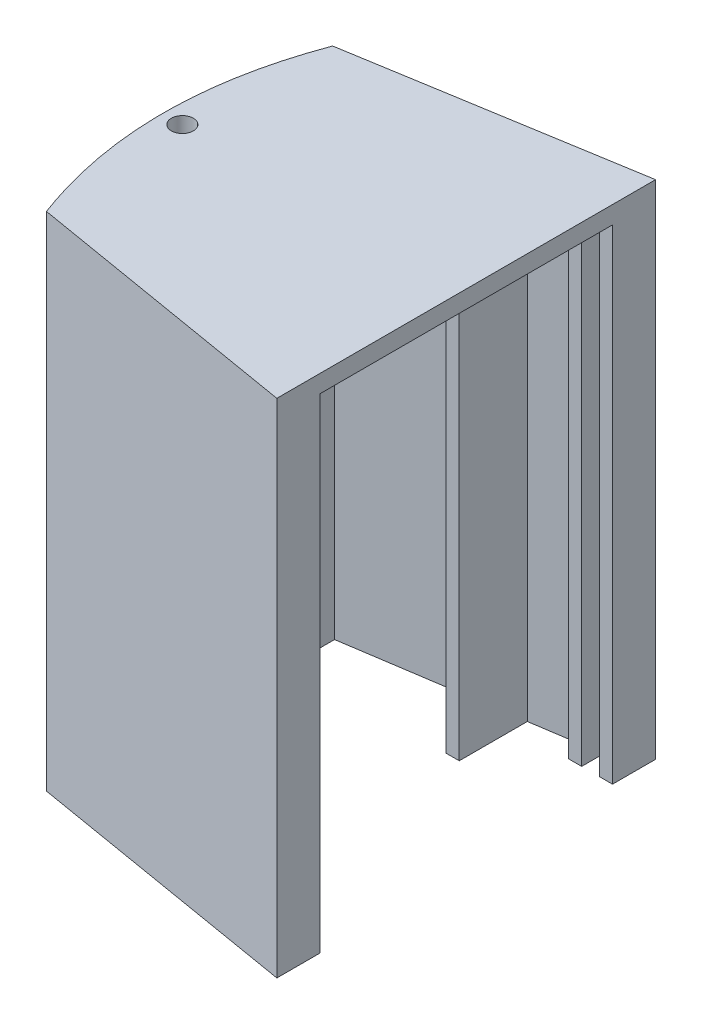
ISO-10303-21;
HEADER;
FILE_DESCRIPTION(('STEP AP214'),'2;1');
FILE_NAME('part.step','',(''),(''),'','','');
FILE_SCHEMA(('AUTOMOTIVE_DESIGN { 1 0 10303 214 1 1 1 1 }'));
ENDSEC;
DATA;
#1=APPLICATION_CONTEXT('core data for automotive mechanical design processes');
#2=APPLICATION_PROTOCOL_DEFINITION('international standard','automotive_design',2000,#1);
#3=PRODUCT_CONTEXT('',#1,'mechanical');
#4=PRODUCT('Part','Part','',(#3));
#5=PRODUCT_RELATED_PRODUCT_CATEGORY('part','',(#4));
#6=PRODUCT_DEFINITION_FORMATION('','',#4);
#7=PRODUCT_DEFINITION_CONTEXT('part definition',#1,'design');
#8=PRODUCT_DEFINITION('design','',#6,#7);
#9=PRODUCT_DEFINITION_SHAPE('','',#8);
#10=(LENGTH_UNIT() NAMED_UNIT(*) SI_UNIT(.MILLI.,.METRE.));
#11=(NAMED_UNIT(*) PLANE_ANGLE_UNIT() SI_UNIT($,.RADIAN.));
#12=(NAMED_UNIT(*) SI_UNIT($,.STERADIAN.) SOLID_ANGLE_UNIT());
#13=UNCERTAINTY_MEASURE_WITH_UNIT(LENGTH_MEASURE(1.E-05),#10,'distance_accuracy_value','');
#14=(GEOMETRIC_REPRESENTATION_CONTEXT(3) GLOBAL_UNCERTAINTY_ASSIGNED_CONTEXT((#13)) GLOBAL_UNIT_ASSIGNED_CONTEXT((#10,
#11,#12)) REPRESENTATION_CONTEXT('',''));
#15=CARTESIAN_POINT('',(0.,0.,0.));
#16=DIRECTION('',(0.,0.,1.));
#17=DIRECTION('',(1.,0.,0.));
#18=AXIS2_PLACEMENT_3D('',#15,#16,#17);
#19=CARTESIAN_POINT('',(27.2040718904746,110.,-33.1151884914395));
#20=DIRECTION('',(0.,0.,-1.));
#21=DIRECTION('',(-1.,0.,0.));
#22=AXIS2_PLACEMENT_3D('',#19,#20,#21);
#23=PLANE('',#22);
#24=DIRECTION('',(1.,0.,0.));
#25=VECTOR('',#24,1.);
#26=CARTESIAN_POINT('',(27.2040718904746,0.,-33.1151884914395));
#27=LINE('',#26,#25);
#28=CARTESIAN_POINT('',(24.2040718904746,0.,-33.1151884914395));
#29=VERTEX_POINT('',#28);
#30=CARTESIAN_POINT('',(27.2040718904746,0.,-33.1151884914395));
#31=VERTEX_POINT('',#30);
#32=EDGE_CURVE('E255',#29,#31,#27,.T.);
#33=ORIENTED_EDGE('',*,*,#32,.T.);
#34=DIRECTION('',(0.,-1.,0.));
#35=VECTOR('',#34,1.);
#36=CARTESIAN_POINT('',(27.2040718904746,110.,-33.1151884914395));
#37=LINE('',#36,#35);
#38=CARTESIAN_POINT('',(27.2040718904746,110.,-33.1151884914395));
#39=VERTEX_POINT('',#38);
#40=EDGE_CURVE('E11',#39,#31,#37,.T.);
#41=ORIENTED_EDGE('',*,*,#40,.F.);
#42=DIRECTION('',(1.,0.,0.));
#43=VECTOR('',#42,1.);
#44=CARTESIAN_POINT('',(27.2040718904746,110.,-33.1151884914395));
#45=LINE('',#44,#43);
#46=CARTESIAN_POINT('',(24.2040718904746,110.,-33.1151884914395));
#47=VERTEX_POINT('',#46);
#48=EDGE_CURVE('E315',#47,#39,#45,.T.);
#49=ORIENTED_EDGE('',*,*,#48,.F.);
#50=DIRECTION('',(0.,-1.,0.));
#51=VECTOR('',#50,1.);
#52=CARTESIAN_POINT('',(24.2040718904746,110.,-33.1151884914395));
#53=LINE('',#52,#51);
#54=EDGE_CURVE('E254',#47,#29,#53,.T.);
#55=ORIENTED_EDGE('',*,*,#54,.T.);
#56=EDGE_LOOP('',(#33,#41,#49,#55));
#57=FACE_BOUND('',#56,.T.);
#58=ADVANCED_FACE('F33',(#57),#23,.F.);
#59=CARTESIAN_POINT('',(-35.7453822194024,110.,-32.5135125971341));
#60=DIRECTION('',(0.162742598197496,0.,0.986668559715941));
#61=DIRECTION('',(0.986668559715941,0.,-0.162742598197496));
#62=AXIS2_PLACEMENT_3D('',#59,#60,#61);
#63=PLANE('',#62);
#64=DIRECTION('',(-0.98666855971594,0.,0.162742598197496));
#65=VECTOR('',#64,1.);
#66=CARTESIAN_POINT('',(-35.7453822194024,0.,-32.5135125971341));
#67=LINE('',#66,#65);
#68=CARTESIAN_POINT('',(27.2040718904746,0.,-42.8964903621343));
#69=VERTEX_POINT('',#68);
#70=CARTESIAN_POINT('',(-35.7453822194024,0.,-32.5135125971341));
#71=VERTEX_POINT('',#70);
#72=EDGE_CURVE('E260',#69,#71,#67,.T.);
#73=ORIENTED_EDGE('',*,*,#72,.T.);
#74=DIRECTION('',(0.,-1.,0.));
#75=VECTOR('',#74,1.);
#76=CARTESIAN_POINT('',(-35.7453822194024,110.,-32.5135125971341));
#77=LINE('',#76,#75);
#78=CARTESIAN_POINT('',(-35.7453822194024,110.,-32.5135125971341));
#79=VERTEX_POINT('',#78);
#80=EDGE_CURVE('E380',#79,#71,#77,.T.);
#81=ORIENTED_EDGE('',*,*,#80,.F.);
#82=DIRECTION('',(0.,-1.,0.));
#83=VECTOR('',#82,1.);
#84=CARTESIAN_POINT('',(-35.7453822194024,114.,-32.5135125971341));
#85=LINE('',#84,#83);
#86=CARTESIAN_POINT('',(-35.7453822194024,114.,-32.5135125971341));
#87=VERTEX_POINT('',#86);
#88=EDGE_CURVE('E416',#87,#79,#85,.T.);
#89=ORIENTED_EDGE('',*,*,#88,.F.);
#90=DIRECTION('',(-0.98666855971594,0.,0.162742598197496));
#91=VECTOR('',#90,1.);
#92=CARTESIAN_POINT('',(-35.7453822194024,114.,-32.5135125971341));
#93=LINE('',#92,#91);
#94=CARTESIAN_POINT('',(27.2040718904746,114.,-42.8964903621343));
#95=VERTEX_POINT('',#94);
#96=EDGE_CURVE('E391',#95,#87,#93,.T.);
#97=ORIENTED_EDGE('',*,*,#96,.F.);
#98=DIRECTION('',(0.,-1.,0.));
#99=VECTOR('',#98,1.);
#100=CARTESIAN_POINT('',(27.2040718904746,110.,-42.8964903621343));
#101=LINE('',#100,#99);
#102=EDGE_CURVE('E41',#95,#69,#101,.T.);
#103=ORIENTED_EDGE('',*,*,#102,.T.);
#104=EDGE_LOOP('',(#73,#81,#89,#97,#103));
#105=FACE_BOUND('',#104,.T.);
#106=ADVANCED_FACE('F387',(#105),#63,.F.);
#107=CARTESIAN_POINT('',(-35.7453822194024,110.,-32.5135125971341));
#108=CARTESIAN_POINT('',(-47.8640782963114,110.,0.00437010478615047));
#109=CARTESIAN_POINT('',(-35.7101712220683,110.,32.509265277089));
#110=B_SPLINE_CURVE_WITH_KNOTS('',2,(#107,#108,#109),.UNSPECIFIED.,.F.,.F.,(3,3),(0.,1.),.UNSPECIFIED.);
#111=DIRECTION('',(0.,-1.,0.));
#112=VECTOR('',#111,1.);
#113=SURFACE_OF_LINEAR_EXTRUSION('',#110,#112);
#114=CARTESIAN_POINT('',(-35.7453822194024,0.,-32.5135125971341));
#115=CARTESIAN_POINT('',(-47.8640782963114,0.,0.00437010478615047));
#116=CARTESIAN_POINT('',(-35.7101712220683,0.,32.509265277089));
#117=B_SPLINE_CURVE_WITH_KNOTS('',2,(#114,#115,#116),.UNSPECIFIED.,.F.,.F.,(3,3),(0.,1.),.UNSPECIFIED.);
#118=CARTESIAN_POINT('',(-35.7101712220683,0.,32.509265277089));
#119=VERTEX_POINT('',#118);
#120=EDGE_CURVE('E262',#71,#119,#117,.T.);
#121=ORIENTED_EDGE('',*,*,#120,.T.);
#122=DIRECTION('',(0.,-1.,0.));
#123=VECTOR('',#122,1.);
#124=CARTESIAN_POINT('',(-35.7101712220683,110.,32.509265277089));
#125=LINE('',#124,#123);
#126=CARTESIAN_POINT('',(-35.7101712220683,110.,32.509265277089));
#127=VERTEX_POINT('',#126);
#128=EDGE_CURVE('E377',#127,#119,#125,.T.);
#129=ORIENTED_EDGE('',*,*,#128,.F.);
#130=EDGE_CURVE('E419',#79,#127,#110,.T.);
#131=ORIENTED_EDGE('',*,*,#130,.F.);
#132=ORIENTED_EDGE('',*,*,#80,.T.);
#133=EDGE_LOOP('',(#121,#129,#131,#132));
#134=FACE_BOUND('',#133,.T.);
#135=ADVANCED_FACE('F401',(#134),#113,.F.);
#136=CARTESIAN_POINT('',(-35.7101712220683,110.,32.509265277089));
#137=DIRECTION('',(0.16605398684603,0.,-0.986116663206002));
#138=DIRECTION('',(-0.986116663206002,0.,-0.16605398684603));
#139=AXIS2_PLACEMENT_3D('',#136,#137,#138);
#140=PLANE('',#139);
#141=DIRECTION('',(0.986116663206001,0.,0.16605398684603));
#142=VECTOR('',#141,1.);
#143=CARTESIAN_POINT('',(-35.7101712220683,0.,32.509265277089));
#144=LINE('',#143,#142);
#145=CARTESIAN_POINT('',(27.2040718904746,0.,43.1035096378657));
#146=VERTEX_POINT('',#145);
#147=EDGE_CURVE('E266',#119,#146,#144,.T.);
#148=ORIENTED_EDGE('',*,*,#147,.T.);
#149=DIRECTION('',(0.,-1.,0.));
#150=VECTOR('',#149,1.);
#151=CARTESIAN_POINT('',(27.2040718904746,110.,43.1035096378657));
#152=LINE('',#151,#150);
#153=CARTESIAN_POINT('',(27.2040718904746,114.,43.1035096378657));
#154=VERTEX_POINT('',#153);
#155=EDGE_CURVE('E374',#154,#146,#152,.T.);
#156=ORIENTED_EDGE('',*,*,#155,.F.);
#157=DIRECTION('',(0.986116663206001,0.,0.16605398684603));
#158=VECTOR('',#157,1.);
#159=CARTESIAN_POINT('',(27.2040718904746,114.,43.1035096378657));
#160=LINE('',#159,#158);
#161=CARTESIAN_POINT('',(-35.7101712220683,114.,32.509265277089));
#162=VERTEX_POINT('',#161);
#163=EDGE_CURVE('E412',#162,#154,#160,.T.);
#164=ORIENTED_EDGE('',*,*,#163,.F.);
#165=DIRECTION('',(0.,-1.,0.));
#166=VECTOR('',#165,1.);
#167=CARTESIAN_POINT('',(-35.7101712220683,114.,32.509265277089));
#168=LINE('',#167,#166);
#169=EDGE_CURVE('E258',#162,#127,#168,.T.);
#170=ORIENTED_EDGE('',*,*,#169,.T.);
#171=ORIENTED_EDGE('',*,*,#128,.T.);
#172=EDGE_LOOP('',(#148,#156,#164,#170,#171));
#173=FACE_BOUND('',#172,.T.);
#174=ADVANCED_FACE('F405',(#173),#140,.F.);
#175=CARTESIAN_POINT('',(27.2040718904746,110.,39.3058641401394));
#176=DIRECTION('',(-1.,0.,0.));
#177=DIRECTION('',(0.,0.,1.));
#178=AXIS2_PLACEMENT_3D('',#175,#176,#177);
#179=PLANE('',#178);
#180=DIRECTION('',(0.,0.,-1.));
#181=VECTOR('',#180,1.);
#182=CARTESIAN_POINT('',(27.2040718904746,0.,39.3058641401394));
#183=LINE('',#182,#181);
#184=CARTESIAN_POINT('',(27.2040718904746,0.,33.3058641401394));
#185=VERTEX_POINT('',#184);
#186=EDGE_CURVE('E272',#146,#185,#183,.T.);
#187=ORIENTED_EDGE('',*,*,#186,.T.);
#188=DIRECTION('',(0.,-1.,0.));
#189=VECTOR('',#188,1.);
#190=CARTESIAN_POINT('',(27.2040718904746,110.,33.3058641401394));
#191=LINE('',#190,#189);
#192=CARTESIAN_POINT('',(27.2040718904746,110.,33.3058641401394));
#193=VERTEX_POINT('',#192);
#194=EDGE_CURVE('E371',#193,#185,#191,.T.);
#195=ORIENTED_EDGE('',*,*,#194,.F.);
#196=DIRECTION('',(0.,0.,-1.));
#197=VECTOR('',#196,1.);
#198=CARTESIAN_POINT('',(27.2040718904746,110.,-42.8964903621343));
#199=LINE('',#198,#197);
#200=EDGE_CURVE('E618',#193,#39,#199,.T.);
#201=ORIENTED_EDGE('',*,*,#200,.T.);
#202=ORIENTED_EDGE('',*,*,#40,.T.);
#203=DIRECTION('',(0.,0.,-1.));
#204=VECTOR('',#203,1.);
#205=CARTESIAN_POINT('',(27.2040718904746,0.,-42.8964903621343));
#206=LINE('',#205,#204);
#207=EDGE_CURVE('E257',#31,#69,#206,.T.);
#208=ORIENTED_EDGE('',*,*,#207,.T.);
#209=ORIENTED_EDGE('',*,*,#102,.F.);
#210=DIRECTION('',(0.,0.,-1.));
#211=VECTOR('',#210,1.);
#212=CARTESIAN_POINT('',(27.2040718904746,114.,-42.8964903621343));
#213=LINE('',#212,#211);
#214=EDGE_CURVE('E629',#154,#95,#213,.T.);
#215=ORIENTED_EDGE('',*,*,#214,.F.);
#216=ORIENTED_EDGE('',*,*,#155,.T.);
#217=EDGE_LOOP('',(#187,#195,#201,#202,#208,#209,#215,#216));
#218=FACE_BOUND('',#217,.T.);
#219=ADVANCED_FACE('F535',(#218),#179,.F.);
#220=CARTESIAN_POINT('',(27.2040718904746,110.,33.3058641401394));
#221=DIRECTION('',(0.,0.,1.));
#222=DIRECTION('',(1.,0.,0.));
#223=AXIS2_PLACEMENT_3D('',#220,#221,#222);
#224=PLANE('',#223);
#225=DIRECTION('',(-1.,0.,0.));
#226=VECTOR('',#225,1.);
#227=CARTESIAN_POINT('',(27.2040718904746,0.,33.3058641401394));
#228=LINE('',#227,#226);
#229=CARTESIAN_POINT('',(24.2040718904746,0.,33.3058641401394));
#230=VERTEX_POINT('',#229);
#231=EDGE_CURVE('E274',#185,#230,#228,.T.);
#232=ORIENTED_EDGE('',*,*,#231,.T.);
#233=DIRECTION('',(0.,-1.,0.));
#234=VECTOR('',#233,1.);
#235=CARTESIAN_POINT('',(24.2040718904746,110.,33.3058641401394));
#236=LINE('',#235,#234);
#237=CARTESIAN_POINT('',(24.2040718904746,110.,33.3058641401394));
#238=VERTEX_POINT('',#237);
#239=EDGE_CURVE('E368',#238,#230,#236,.T.);
#240=ORIENTED_EDGE('',*,*,#239,.F.);
#241=DIRECTION('',(-1.,0.,0.));
#242=VECTOR('',#241,1.);
#243=CARTESIAN_POINT('',(27.2040718904746,110.,33.3058641401394));
#244=LINE('',#243,#242);
#245=EDGE_CURVE('E421',#193,#238,#244,.T.);
#246=ORIENTED_EDGE('',*,*,#245,.F.);
#247=ORIENTED_EDGE('',*,*,#194,.T.);
#248=EDGE_LOOP('',(#232,#240,#246,#247));
#249=FACE_BOUND('',#248,.T.);
#250=ADVANCED_FACE('F532',(#249),#224,.F.);
#251=CARTESIAN_POINT('',(24.2040718904746,110.,33.3058641401394));
#252=DIRECTION('',(1.,0.,0.));
#253=DIRECTION('',(0.,0.,-1.));
#254=AXIS2_PLACEMENT_3D('',#251,#252,#253);
#255=PLANE('',#254);
#256=DIRECTION('',(0.,0.,1.));
#257=VECTOR('',#256,1.);
#258=CARTESIAN_POINT('',(24.2040718904746,0.,33.3058641401394));
#259=LINE('',#258,#257);
#260=CARTESIAN_POINT('',(24.2040718904746,0.,38.8405709331325));
#261=VERTEX_POINT('',#260);
#262=EDGE_CURVE('E276',#230,#261,#259,.T.);
#263=ORIENTED_EDGE('',*,*,#262,.T.);
#264=DIRECTION('',(0.,-1.,0.));
#265=VECTOR('',#264,1.);
#266=CARTESIAN_POINT('',(24.2040718904746,110.,38.8405709331325));
#267=LINE('',#266,#265);
#268=CARTESIAN_POINT('',(24.2040718904746,110.,38.8405709331325));
#269=VERTEX_POINT('',#268);
#270=EDGE_CURVE('E365',#269,#261,#267,.T.);
#271=ORIENTED_EDGE('',*,*,#270,.F.);
#272=DIRECTION('',(0.,0.,1.));
#273=VECTOR('',#272,1.);
#274=CARTESIAN_POINT('',(24.2040718904746,110.,33.3058641401394));
#275=LINE('',#274,#273);
#276=EDGE_CURVE('E424',#238,#269,#275,.T.);
#277=ORIENTED_EDGE('',*,*,#276,.F.);
#278=ORIENTED_EDGE('',*,*,#239,.T.);
#279=EDGE_LOOP('',(#263,#271,#277,#278));
#280=FACE_BOUND('',#279,.T.);
#281=ADVANCED_FACE('F528',(#280),#255,.F.);
#282=CARTESIAN_POINT('',(20.2040718904746,110.,38.2201799904565));
#283=DIRECTION('',(-0.15326526872754,0.,0.988185082563927));
#284=DIRECTION('',(0.988185082563927,0.,0.15326526872754));
#285=AXIS2_PLACEMENT_3D('',#282,#283,#284);
#286=PLANE('',#285);
#287=DIRECTION('',(-0.988185082563927,0.,-0.15326526872754));
#288=VECTOR('',#287,1.);
#289=CARTESIAN_POINT('',(20.2040718904746,0.,38.2201799904565));
#290=LINE('',#289,#288);
#291=CARTESIAN_POINT('',(20.2040718904746,0.,38.2201799904565));
#292=VERTEX_POINT('',#291);
#293=EDGE_CURVE('E278',#261,#292,#290,.T.);
#294=ORIENTED_EDGE('',*,*,#293,.T.);
#295=DIRECTION('',(0.,-1.,0.));
#296=VECTOR('',#295,1.);
#297=CARTESIAN_POINT('',(20.2040718904746,110.,38.2201799904565));
#298=LINE('',#297,#296);
#299=CARTESIAN_POINT('',(20.2040718904746,110.,38.2201799904565));
#300=VERTEX_POINT('',#299);
#301=EDGE_CURVE('E362',#300,#292,#298,.T.);
#302=ORIENTED_EDGE('',*,*,#301,.F.);
#303=DIRECTION('',(-0.988185082563927,0.,-0.15326526872754));
#304=VECTOR('',#303,1.);
#305=CARTESIAN_POINT('',(20.2040718904746,110.,38.2201799904565));
#306=LINE('',#305,#304);
#307=EDGE_CURVE('E549',#269,#300,#306,.T.);
#308=ORIENTED_EDGE('',*,*,#307,.F.);
#309=ORIENTED_EDGE('',*,*,#270,.T.);
#310=EDGE_LOOP('',(#294,#302,#308,#309));
#311=FACE_BOUND('',#310,.T.);
#312=ADVANCED_FACE('F524',(#311),#286,.F.);
#313=CARTESIAN_POINT('',(20.2040718904746,110.,33.3058641401394));
#314=DIRECTION('',(-1.,0.,0.));
#315=DIRECTION('',(0.,0.,1.));
#316=AXIS2_PLACEMENT_3D('',#313,#314,#315);
#317=PLANE('',#316);
#318=DIRECTION('',(0.,0.,-1.));
#319=VECTOR('',#318,1.);
#320=CARTESIAN_POINT('',(20.2040718904746,0.,33.3058641401394));
#321=LINE('',#320,#319);
#322=CARTESIAN_POINT('',(20.2040718904746,0.,33.3058641401394));
#323=VERTEX_POINT('',#322);
#324=EDGE_CURVE('E280',#292,#323,#321,.T.);
#325=ORIENTED_EDGE('',*,*,#324,.T.);
#326=DIRECTION('',(0.,-1.,0.));
#327=VECTOR('',#326,1.);
#328=CARTESIAN_POINT('',(20.2040718904746,110.,33.3058641401394));
#329=LINE('',#328,#327);
#330=CARTESIAN_POINT('',(20.2040718904746,110.,33.3058641401394));
#331=VERTEX_POINT('',#330);
#332=EDGE_CURVE('E359',#331,#323,#329,.T.);
#333=ORIENTED_EDGE('',*,*,#332,.F.);
#334=DIRECTION('',(0.,0.,-1.));
#335=VECTOR('',#334,1.);
#336=CARTESIAN_POINT('',(20.2040718904746,110.,33.3058641401394));
#337=LINE('',#336,#335);
#338=EDGE_CURVE('E553',#300,#331,#337,.T.);
#339=ORIENTED_EDGE('',*,*,#338,.F.);
#340=ORIENTED_EDGE('',*,*,#301,.T.);
#341=EDGE_LOOP('',(#325,#333,#339,#340));
#342=FACE_BOUND('',#341,.T.);
#343=ADVANCED_FACE('F520',(#342),#317,.F.);
#344=CARTESIAN_POINT('',(17.2040718904746,110.,33.3058641401394));
#345=DIRECTION('',(0.,0.,1.));
#346=DIRECTION('',(1.,0.,0.));
#347=AXIS2_PLACEMENT_3D('',#344,#345,#346);
#348=PLANE('',#347);
#349=DIRECTION('',(-1.,0.,0.));
#350=VECTOR('',#349,1.);
#351=CARTESIAN_POINT('',(17.2040718904746,0.,33.3058641401394));
#352=LINE('',#351,#350);
#353=CARTESIAN_POINT('',(17.2040718904746,0.,33.3058641401394));
#354=VERTEX_POINT('',#353);
#355=EDGE_CURVE('E282',#323,#354,#352,.T.);
#356=ORIENTED_EDGE('',*,*,#355,.T.);
#357=DIRECTION('',(0.,-1.,0.));
#358=VECTOR('',#357,1.);
#359=CARTESIAN_POINT('',(17.2040718904746,110.,33.3058641401394));
#360=LINE('',#359,#358);
#361=CARTESIAN_POINT('',(17.2040718904746,110.,33.3058641401394));
#362=VERTEX_POINT('',#361);
#363=EDGE_CURVE('E356',#362,#354,#360,.T.);
#364=ORIENTED_EDGE('',*,*,#363,.F.);
#365=DIRECTION('',(-1.,0.,0.));
#366=VECTOR('',#365,1.);
#367=CARTESIAN_POINT('',(17.2040718904746,110.,33.3058641401394));
#368=LINE('',#367,#366);
#369=EDGE_CURVE('E557',#331,#362,#368,.T.);
#370=ORIENTED_EDGE('',*,*,#369,.F.);
#371=ORIENTED_EDGE('',*,*,#332,.T.);
#372=EDGE_LOOP('',(#356,#364,#370,#371));
#373=FACE_BOUND('',#372,.T.);
#374=ADVANCED_FACE('F516',(#373),#348,.F.);
#375=CARTESIAN_POINT('',(17.2040718904746,110.,33.3058641401394));
#376=DIRECTION('',(1.,0.,0.));
#377=DIRECTION('',(0.,0.,-1.));
#378=AXIS2_PLACEMENT_3D('',#375,#376,#377);
#379=PLANE('',#378);
#380=DIRECTION('',(0.,0.,1.));
#381=VECTOR('',#380,1.);
#382=CARTESIAN_POINT('',(17.2040718904746,0.,33.3058641401394));
#383=LINE('',#382,#381);
#384=CARTESIAN_POINT('',(17.2040718904746,0.,37.7548867834495));
#385=VERTEX_POINT('',#384);
#386=EDGE_CURVE('E284',#354,#385,#383,.T.);
#387=ORIENTED_EDGE('',*,*,#386,.T.);
#388=DIRECTION('',(0.,-1.,0.));
#389=VECTOR('',#388,1.);
#390=CARTESIAN_POINT('',(17.2040718904746,110.,37.7548867834495));
#391=LINE('',#390,#389);
#392=CARTESIAN_POINT('',(17.2040718904746,110.,37.7548867834495));
#393=VERTEX_POINT('',#392);
#394=EDGE_CURVE('E353',#393,#385,#391,.T.);
#395=ORIENTED_EDGE('',*,*,#394,.F.);
#396=DIRECTION('',(0.,0.,1.));
#397=VECTOR('',#396,1.);
#398=CARTESIAN_POINT('',(17.2040718904746,110.,33.3058641401394));
#399=LINE('',#398,#397);
#400=EDGE_CURVE('E560',#362,#393,#399,.T.);
#401=ORIENTED_EDGE('',*,*,#400,.F.);
#402=ORIENTED_EDGE('',*,*,#363,.T.);
#403=EDGE_LOOP('',(#387,#395,#401,#402));
#404=FACE_BOUND('',#403,.T.);
#405=ADVANCED_FACE('F512',(#404),#379,.F.);
#406=CARTESIAN_POINT('',(5.20407189047457,110.,35.8937139554216));
#407=DIRECTION('',(-0.153265268727539,0.,0.988185082563927));
#408=DIRECTION('',(0.988185082563927,0.,0.153265268727539));
#409=AXIS2_PLACEMENT_3D('',#406,#407,#408);
#410=PLANE('',#409);
#411=DIRECTION('',(-0.988185082563927,0.,-0.153265268727539));
#412=VECTOR('',#411,1.);
#413=CARTESIAN_POINT('',(5.20407189047457,0.,35.8937139554216));
#414=LINE('',#413,#412);
#415=CARTESIAN_POINT('',(5.20407189047457,0.,35.8937139554216));
#416=VERTEX_POINT('',#415);
#417=EDGE_CURVE('E286',#385,#416,#414,.T.);
#418=ORIENTED_EDGE('',*,*,#417,.T.);
#419=DIRECTION('',(0.,-1.,0.));
#420=VECTOR('',#419,1.);
#421=CARTESIAN_POINT('',(5.20407189047457,110.,35.8937139554216));
#422=LINE('',#421,#420);
#423=CARTESIAN_POINT('',(5.20407189047457,110.,35.8937139554216));
#424=VERTEX_POINT('',#423);
#425=EDGE_CURVE('E350',#424,#416,#422,.T.);
#426=ORIENTED_EDGE('',*,*,#425,.F.);
#427=DIRECTION('',(-0.988185082563927,0.,-0.153265268727539));
#428=VECTOR('',#427,1.);
#429=CARTESIAN_POINT('',(5.20407189047457,110.,35.8937139554216));
#430=LINE('',#429,#428);
#431=EDGE_CURVE('E563',#393,#424,#430,.T.);
#432=ORIENTED_EDGE('',*,*,#431,.F.);
#433=ORIENTED_EDGE('',*,*,#394,.T.);
#434=EDGE_LOOP('',(#418,#426,#432,#433));
#435=FACE_BOUND('',#434,.T.);
#436=ADVANCED_FACE('F508',(#435),#410,.F.);
#437=CARTESIAN_POINT('',(5.20407189047457,110.,20.4284207484147));
#438=DIRECTION('',(-1.,0.,0.));
#439=DIRECTION('',(0.,0.,1.));
#440=AXIS2_PLACEMENT_3D('',#437,#438,#439);
#441=PLANE('',#440);
#442=DIRECTION('',(0.,0.,-1.));
#443=VECTOR('',#442,1.);
#444=CARTESIAN_POINT('',(5.20407189047457,0.,20.4284207484147));
#445=LINE('',#444,#443);
#446=CARTESIAN_POINT('',(5.20407189047457,0.,20.4284207484147));
#447=VERTEX_POINT('',#446);
#448=EDGE_CURVE('E288',#416,#447,#445,.T.);
#449=ORIENTED_EDGE('',*,*,#448,.T.);
#450=DIRECTION('',(0.,-1.,0.));
#451=VECTOR('',#450,1.);
#452=CARTESIAN_POINT('',(5.20407189047457,110.,20.4284207484147));
#453=LINE('',#452,#451);
#454=CARTESIAN_POINT('',(5.20407189047457,110.,20.4284207484147));
#455=VERTEX_POINT('',#454);
#456=EDGE_CURVE('E347',#455,#447,#453,.T.);
#457=ORIENTED_EDGE('',*,*,#456,.F.);
#458=DIRECTION('',(0.,0.,-1.));
#459=VECTOR('',#458,1.);
#460=CARTESIAN_POINT('',(5.20407189047457,110.,20.4284207484147));
#461=LINE('',#460,#459);
#462=EDGE_CURVE('E566',#424,#455,#461,.T.);
#463=ORIENTED_EDGE('',*,*,#462,.F.);
#464=ORIENTED_EDGE('',*,*,#425,.T.);
#465=EDGE_LOOP('',(#449,#457,#463,#464));
#466=FACE_BOUND('',#465,.T.);
#467=ADVANCED_FACE('F504',(#466),#441,.F.);
#468=CARTESIAN_POINT('',(5.20407189047457,110.,20.4284207484147));
#469=DIRECTION('',(0.,0.,1.));
#470=DIRECTION('',(1.,0.,0.));
#471=AXIS2_PLACEMENT_3D('',#468,#469,#470);
#472=PLANE('',#471);
#473=DIRECTION('',(-1.,0.,0.));
#474=VECTOR('',#473,1.);
#475=CARTESIAN_POINT('',(5.20407189047457,0.,20.4284207484147));
#476=LINE('',#475,#474);
#477=CARTESIAN_POINT('',(2.20407189047456,0.,20.4284207484147));
#478=VERTEX_POINT('',#477);
#479=EDGE_CURVE('E290',#447,#478,#476,.T.);
#480=ORIENTED_EDGE('',*,*,#479,.T.);
#481=DIRECTION('',(0.,-1.,0.));
#482=VECTOR('',#481,1.);
#483=CARTESIAN_POINT('',(2.20407189047456,110.,20.4284207484147));
#484=LINE('',#483,#482);
#485=CARTESIAN_POINT('',(2.20407189047456,110.,20.4284207484147));
#486=VERTEX_POINT('',#485);
#487=EDGE_CURVE('E344',#486,#478,#484,.T.);
#488=ORIENTED_EDGE('',*,*,#487,.F.);
#489=DIRECTION('',(-1.,0.,0.));
#490=VECTOR('',#489,1.);
#491=CARTESIAN_POINT('',(5.20407189047457,110.,20.4284207484147));
#492=LINE('',#491,#490);
#493=EDGE_CURVE('E569',#455,#486,#492,.T.);
#494=ORIENTED_EDGE('',*,*,#493,.F.);
#495=ORIENTED_EDGE('',*,*,#456,.T.);
#496=EDGE_LOOP('',(#480,#488,#494,#495));
#497=FACE_BOUND('',#496,.T.);
#498=ADVANCED_FACE('F500',(#497),#472,.F.);
#499=CARTESIAN_POINT('',(2.20407189047456,110.,20.4284207484147));
#500=DIRECTION('',(1.,0.,0.));
#501=DIRECTION('',(0.,0.,-1.));
#502=AXIS2_PLACEMENT_3D('',#499,#500,#501);
#503=PLANE('',#502);
#504=DIRECTION('',(0.,0.,1.));
#505=VECTOR('',#504,1.);
#506=CARTESIAN_POINT('',(2.20407189047456,0.,20.4284207484147));
#507=LINE('',#506,#505);
#508=CARTESIAN_POINT('',(2.20407189047456,0.,35.4284207484147));
#509=VERTEX_POINT('',#508);
#510=EDGE_CURVE('E292',#478,#509,#507,.T.);
#511=ORIENTED_EDGE('',*,*,#510,.T.);
#512=DIRECTION('',(0.,-1.,0.));
#513=VECTOR('',#512,1.);
#514=CARTESIAN_POINT('',(2.20407189047456,110.,35.4284207484147));
#515=LINE('',#514,#513);
#516=CARTESIAN_POINT('',(2.20407189047456,110.,35.4284207484147));
#517=VERTEX_POINT('',#516);
#518=EDGE_CURVE('E341',#517,#509,#515,.T.);
#519=ORIENTED_EDGE('',*,*,#518,.F.);
#520=DIRECTION('',(0.,0.,1.));
#521=VECTOR('',#520,1.);
#522=CARTESIAN_POINT('',(2.20407189047456,110.,20.4284207484147));
#523=LINE('',#522,#521);
#524=EDGE_CURVE('E572',#486,#517,#523,.T.);
#525=ORIENTED_EDGE('',*,*,#524,.F.);
#526=ORIENTED_EDGE('',*,*,#487,.T.);
#527=EDGE_LOOP('',(#511,#519,#525,#526));
#528=FACE_BOUND('',#527,.T.);
#529=ADVANCED_FACE('F496',(#528),#503,.F.);
#530=CARTESIAN_POINT('',(-32.7959281095254,110.,30.));
#531=DIRECTION('',(-0.15326526872754,0.,0.988185082563927));
#532=DIRECTION('',(0.988185082563927,0.,0.15326526872754));
#533=AXIS2_PLACEMENT_3D('',#530,#531,#532);
#534=PLANE('',#533);
#535=DIRECTION('',(-0.988185082563927,0.,-0.15326526872754));
#536=VECTOR('',#535,1.);
#537=CARTESIAN_POINT('',(-32.7959281095254,0.,30.));
#538=LINE('',#537,#536);
#539=CARTESIAN_POINT('',(-32.7959281095254,0.,30.));
#540=VERTEX_POINT('',#539);
#541=EDGE_CURVE('E294',#509,#540,#538,.T.);
#542=ORIENTED_EDGE('',*,*,#541,.T.);
#543=DIRECTION('',(0.,-1.,0.));
#544=VECTOR('',#543,1.);
#545=CARTESIAN_POINT('',(-32.7959281095254,110.,30.));
#546=LINE('',#545,#544);
#547=CARTESIAN_POINT('',(-32.7959281095254,110.,30.));
#548=VERTEX_POINT('',#547);
#549=EDGE_CURVE('E338',#548,#540,#546,.T.);
#550=ORIENTED_EDGE('',*,*,#549,.F.);
#551=DIRECTION('',(-0.988185082563927,0.,-0.15326526872754));
#552=VECTOR('',#551,1.);
#553=CARTESIAN_POINT('',(-32.7959281095254,110.,30.));
#554=LINE('',#553,#552);
#555=EDGE_CURVE('E575',#517,#548,#554,.T.);
#556=ORIENTED_EDGE('',*,*,#555,.F.);
#557=ORIENTED_EDGE('',*,*,#518,.T.);
#558=EDGE_LOOP('',(#542,#550,#556,#557));
#559=FACE_BOUND('',#558,.T.);
#560=ADVANCED_FACE('F492',(#559),#534,.F.);
#561=CARTESIAN_POINT('',(-32.7959281095254,110.,-30.));
#562=DIRECTION('',(-1.,0.,0.));
#563=DIRECTION('',(0.,0.,1.));
#564=AXIS2_PLACEMENT_3D('',#561,#562,#563);
#565=PLANE('',#564);
#566=DIRECTION('',(0.,0.,-1.));
#567=VECTOR('',#566,1.);
#568=CARTESIAN_POINT('',(-32.7959281095254,0.,-30.));
#569=LINE('',#568,#567);
#570=CARTESIAN_POINT('',(-32.7959281095254,0.,-30.));
#571=VERTEX_POINT('',#570);
#572=EDGE_CURVE('E296',#540,#571,#569,.T.);
#573=ORIENTED_EDGE('',*,*,#572,.T.);
#574=DIRECTION('',(0.,-1.,0.));
#575=VECTOR('',#574,1.);
#576=CARTESIAN_POINT('',(-32.7959281095254,110.,-30.));
#577=LINE('',#576,#575);
#578=CARTESIAN_POINT('',(-32.7959281095254,110.,-30.));
#579=VERTEX_POINT('',#578);
#580=EDGE_CURVE('E335',#579,#571,#577,.T.);
#581=ORIENTED_EDGE('',*,*,#580,.F.);
#582=DIRECTION('',(0.,0.,-1.));
#583=VECTOR('',#582,1.);
#584=CARTESIAN_POINT('',(-32.7959281095254,110.,-30.));
#585=LINE('',#584,#583);
#586=EDGE_CURVE('E578',#548,#579,#585,.T.);
#587=ORIENTED_EDGE('',*,*,#586,.F.);
#588=ORIENTED_EDGE('',*,*,#549,.T.);
#589=EDGE_LOOP('',(#573,#581,#587,#588));
#590=FACE_BOUND('',#589,.T.);
#591=ADVANCED_FACE('F488',(#590),#565,.F.);
#592=CARTESIAN_POINT('',(-32.7959281095254,110.,-30.));
#593=DIRECTION('',(-0.150196455879044,0.,-0.988656171093558));
#594=DIRECTION('',(-0.988656171093558,0.,0.150196455879044));
#595=AXIS2_PLACEMENT_3D('',#592,#593,#594);
#596=PLANE('',#595);
#597=DIRECTION('',(0.988656171093558,0.,-0.150196455879044));
#598=VECTOR('',#597,1.);
#599=CARTESIAN_POINT('',(-32.7959281095254,0.,-30.));
#600=LINE('',#599,#598);
#601=CARTESIAN_POINT('',(2.20407189047456,0.,-35.317193286673));
#602=VERTEX_POINT('',#601);
#603=EDGE_CURVE('E298',#571,#602,#600,.T.);
#604=ORIENTED_EDGE('',*,*,#603,.T.);
#605=DIRECTION('',(0.,-1.,0.));
#606=VECTOR('',#605,1.);
#607=CARTESIAN_POINT('',(2.20407189047456,110.,-35.317193286673));
#608=LINE('',#607,#606);
#609=CARTESIAN_POINT('',(2.20407189047456,110.,-35.317193286673));
#610=VERTEX_POINT('',#609);
#611=EDGE_CURVE('E332',#610,#602,#608,.T.);
#612=ORIENTED_EDGE('',*,*,#611,.F.);
#613=DIRECTION('',(0.988656171093558,0.,-0.150196455879044));
#614=VECTOR('',#613,1.);
#615=CARTESIAN_POINT('',(-32.7959281095254,110.,-30.));
#616=LINE('',#615,#614);
#617=EDGE_CURVE('E581',#579,#610,#616,.T.);
#618=ORIENTED_EDGE('',*,*,#617,.F.);
#619=ORIENTED_EDGE('',*,*,#580,.T.);
#620=EDGE_LOOP('',(#604,#612,#618,#619));
#621=FACE_BOUND('',#620,.T.);
#622=ADVANCED_FACE('F484',(#621),#596,.F.);
#623=CARTESIAN_POINT('',(2.20407189047456,110.,-20.317193286673));
#624=DIRECTION('',(1.,0.,0.));
#625=DIRECTION('',(0.,0.,-1.));
#626=AXIS2_PLACEMENT_3D('',#623,#624,#625);
#627=PLANE('',#626);
#628=DIRECTION('',(0.,0.,1.));
#629=VECTOR('',#628,1.);
#630=CARTESIAN_POINT('',(2.20407189047456,0.,-20.317193286673));
#631=LINE('',#630,#629);
#632=CARTESIAN_POINT('',(2.20407189047456,0.,-20.317193286673));
#633=VERTEX_POINT('',#632);
#634=EDGE_CURVE('E300',#602,#633,#631,.T.);
#635=ORIENTED_EDGE('',*,*,#634,.T.);
#636=DIRECTION('',(0.,-1.,0.));
#637=VECTOR('',#636,1.);
#638=CARTESIAN_POINT('',(2.20407189047456,110.,-20.317193286673));
#639=LINE('',#638,#637);
#640=CARTESIAN_POINT('',(2.20407189047456,110.,-20.317193286673));
#641=VERTEX_POINT('',#640);
#642=EDGE_CURVE('E329',#641,#633,#639,.T.);
#643=ORIENTED_EDGE('',*,*,#642,.F.);
#644=DIRECTION('',(0.,0.,1.));
#645=VECTOR('',#644,1.);
#646=CARTESIAN_POINT('',(2.20407189047456,110.,-20.317193286673));
#647=LINE('',#646,#645);
#648=EDGE_CURVE('E584',#610,#641,#647,.T.);
#649=ORIENTED_EDGE('',*,*,#648,.F.);
#650=ORIENTED_EDGE('',*,*,#611,.T.);
#651=EDGE_LOOP('',(#635,#643,#649,#650));
#652=FACE_BOUND('',#651,.T.);
#653=ADVANCED_FACE('F480',(#652),#627,.F.);
#654=CARTESIAN_POINT('',(5.20407189047457,110.,-20.317193286673));
#655=DIRECTION('',(0.,0.,-1.));
#656=DIRECTION('',(-1.,0.,0.));
#657=AXIS2_PLACEMENT_3D('',#654,#655,#656);
#658=PLANE('',#657);
#659=DIRECTION('',(1.,0.,0.));
#660=VECTOR('',#659,1.);
#661=CARTESIAN_POINT('',(5.20407189047457,0.,-20.317193286673));
#662=LINE('',#661,#660);
#663=CARTESIAN_POINT('',(5.20407189047457,0.,-20.317193286673));
#664=VERTEX_POINT('',#663);
#665=EDGE_CURVE('E302',#633,#664,#662,.T.);
#666=ORIENTED_EDGE('',*,*,#665,.T.);
#667=DIRECTION('',(0.,-1.,0.));
#668=VECTOR('',#667,1.);
#669=CARTESIAN_POINT('',(5.20407189047457,110.,-20.317193286673));
#670=LINE('',#669,#668);
#671=CARTESIAN_POINT('',(5.20407189047457,110.,-20.317193286673));
#672=VERTEX_POINT('',#671);
#673=EDGE_CURVE('E326',#672,#664,#670,.T.);
#674=ORIENTED_EDGE('',*,*,#673,.F.);
#675=DIRECTION('',(1.,0.,0.));
#676=VECTOR('',#675,1.);
#677=CARTESIAN_POINT('',(5.20407189047457,110.,-20.317193286673));
#678=LINE('',#677,#676);
#679=EDGE_CURVE('E587',#641,#672,#678,.T.);
#680=ORIENTED_EDGE('',*,*,#679,.F.);
#681=ORIENTED_EDGE('',*,*,#642,.T.);
#682=EDGE_LOOP('',(#666,#674,#680,#681));
#683=FACE_BOUND('',#682,.T.);
#684=ADVANCED_FACE('F476',(#683),#658,.F.);
#685=CARTESIAN_POINT('',(5.20407189047457,110.,-20.317193286673));
#686=DIRECTION('',(-1.,0.,0.));
#687=DIRECTION('',(0.,0.,1.));
#688=AXIS2_PLACEMENT_3D('',#685,#686,#687);
#689=PLANE('',#688);
#690=DIRECTION('',(0.,0.,-1.));
#691=VECTOR('',#690,1.);
#692=CARTESIAN_POINT('',(5.20407189047457,0.,-20.317193286673));
#693=LINE('',#692,#691);
#694=CARTESIAN_POINT('',(5.20407189047457,0.,-35.772952711245));
#695=VERTEX_POINT('',#694);
#696=EDGE_CURVE('E304',#664,#695,#693,.T.);
#697=ORIENTED_EDGE('',*,*,#696,.T.);
#698=DIRECTION('',(0.,-1.,0.));
#699=VECTOR('',#698,1.);
#700=CARTESIAN_POINT('',(5.20407189047457,110.,-35.772952711245));
#701=LINE('',#700,#699);
#702=CARTESIAN_POINT('',(5.20407189047457,110.,-35.772952711245));
#703=VERTEX_POINT('',#702);
#704=EDGE_CURVE('E323',#703,#695,#701,.T.);
#705=ORIENTED_EDGE('',*,*,#704,.F.);
#706=DIRECTION('',(0.,0.,-1.));
#707=VECTOR('',#706,1.);
#708=CARTESIAN_POINT('',(5.20407189047457,110.,-20.317193286673));
#709=LINE('',#708,#707);
#710=EDGE_CURVE('E590',#672,#703,#709,.T.);
#711=ORIENTED_EDGE('',*,*,#710,.F.);
#712=ORIENTED_EDGE('',*,*,#673,.T.);
#713=EDGE_LOOP('',(#697,#705,#711,#712));
#714=FACE_BOUND('',#713,.T.);
#715=ADVANCED_FACE('F472',(#714),#689,.F.);
#716=CARTESIAN_POINT('',(5.20407189047457,110.,-35.772952711245));
#717=DIRECTION('',(-0.150196455879044,0.,-0.988656171093558));
#718=DIRECTION('',(-0.988656171093558,0.,0.150196455879044));
#719=AXIS2_PLACEMENT_3D('',#716,#717,#718);
#720=PLANE('',#719);
#721=DIRECTION('',(0.988656171093558,0.,-0.150196455879044));
#722=VECTOR('',#721,1.);
#723=CARTESIAN_POINT('',(5.20407189047457,0.,-35.772952711245));
#724=LINE('',#723,#722);
#725=CARTESIAN_POINT('',(17.2040718904746,0.,-37.5959904095329));
#726=VERTEX_POINT('',#725);
#727=EDGE_CURVE('E306',#695,#726,#724,.T.);
#728=ORIENTED_EDGE('',*,*,#727,.T.);
#729=DIRECTION('',(0.,-1.,0.));
#730=VECTOR('',#729,1.);
#731=CARTESIAN_POINT('',(17.2040718904746,110.,-37.5959904095329));
#732=LINE('',#731,#730);
#733=CARTESIAN_POINT('',(17.2040718904746,110.,-37.5959904095329));
#734=VERTEX_POINT('',#733);
#735=EDGE_CURVE('E320',#734,#726,#732,.T.);
#736=ORIENTED_EDGE('',*,*,#735,.F.);
#737=DIRECTION('',(0.988656171093558,0.,-0.150196455879044));
#738=VECTOR('',#737,1.);
#739=CARTESIAN_POINT('',(5.20407189047457,110.,-35.772952711245));
#740=LINE('',#739,#738);
#741=EDGE_CURVE('E247',#703,#734,#740,.T.);
#742=ORIENTED_EDGE('',*,*,#741,.F.);
#743=ORIENTED_EDGE('',*,*,#704,.T.);
#744=EDGE_LOOP('',(#728,#736,#742,#743));
#745=FACE_BOUND('',#744,.T.);
#746=ADVANCED_FACE('F468',(#745),#720,.F.);
#747=CARTESIAN_POINT('',(17.2040718904746,110.,-33.1151884914395));
#748=DIRECTION('',(1.,0.,0.));
#749=DIRECTION('',(0.,0.,-1.));
#750=AXIS2_PLACEMENT_3D('',#747,#748,#749);
#751=PLANE('',#750);
#752=DIRECTION('',(0.,0.,1.));
#753=VECTOR('',#752,1.);
#754=CARTESIAN_POINT('',(17.2040718904746,0.,-33.1151884914395));
#755=LINE('',#754,#753);
#756=CARTESIAN_POINT('',(17.2040718904746,0.,-33.1151884914395));
#757=VERTEX_POINT('',#756);
#758=EDGE_CURVE('E308',#726,#757,#755,.T.);
#759=ORIENTED_EDGE('',*,*,#758,.T.);
#760=DIRECTION('',(0.,-1.,0.));
#761=VECTOR('',#760,1.);
#762=CARTESIAN_POINT('',(17.2040718904746,110.,-33.1151884914395));
#763=LINE('',#762,#761);
#764=CARTESIAN_POINT('',(17.2040718904746,110.,-33.1151884914395));
#765=VERTEX_POINT('',#764);
#766=EDGE_CURVE('E231',#765,#757,#763,.T.);
#767=ORIENTED_EDGE('',*,*,#766,.F.);
#768=DIRECTION('',(0.,0.,1.));
#769=VECTOR('',#768,1.);
#770=CARTESIAN_POINT('',(17.2040718904746,110.,-33.1151884914395));
#771=LINE('',#770,#769);
#772=EDGE_CURVE('E245',#734,#765,#771,.T.);
#773=ORIENTED_EDGE('',*,*,#772,.F.);
#774=ORIENTED_EDGE('',*,*,#735,.T.);
#775=EDGE_LOOP('',(#759,#767,#773,#774));
#776=FACE_BOUND('',#775,.T.);
#777=ADVANCED_FACE('F465',(#776),#751,.F.);
#778=CARTESIAN_POINT('',(17.2040718904746,110.,-33.1151884914395));
#779=DIRECTION('',(0.,0.,-1.));
#780=DIRECTION('',(-1.,0.,0.));
#781=AXIS2_PLACEMENT_3D('',#778,#779,#780);
#782=PLANE('',#781);
#783=DIRECTION('',(1.,0.,0.));
#784=VECTOR('',#783,1.);
#785=CARTESIAN_POINT('',(17.2040718904746,0.,-33.1151884914395));
#786=LINE('',#785,#784);
#787=CARTESIAN_POINT('',(20.2040718904746,0.,-33.1151884914395));
#788=VERTEX_POINT('',#787);
#789=EDGE_CURVE('E228',#757,#788,#786,.T.);
#790=ORIENTED_EDGE('',*,*,#789,.T.);
#791=DIRECTION('',(0.,-1.,0.));
#792=VECTOR('',#791,1.);
#793=CARTESIAN_POINT('',(20.2040718904746,110.,-33.1151884914395));
#794=LINE('',#793,#792);
#795=CARTESIAN_POINT('',(20.2040718904746,110.,-33.1151884914395));
#796=VERTEX_POINT('',#795);
#797=EDGE_CURVE('E220',#796,#788,#794,.T.);
#798=ORIENTED_EDGE('',*,*,#797,.F.);
#799=DIRECTION('',(1.,0.,0.));
#800=VECTOR('',#799,1.);
#801=CARTESIAN_POINT('',(17.2040718904746,110.,-33.1151884914395));
#802=LINE('',#801,#800);
#803=EDGE_CURVE('E225',#765,#796,#802,.T.);
#804=ORIENTED_EDGE('',*,*,#803,.F.);
#805=ORIENTED_EDGE('',*,*,#766,.T.);
#806=EDGE_LOOP('',(#790,#798,#804,#805));
#807=FACE_BOUND('',#806,.T.);
#808=ADVANCED_FACE('F222',(#807),#782,.F.);
#809=CARTESIAN_POINT('',(20.2040718904746,110.,-33.1151884914395));
#810=DIRECTION('',(-1.,0.,0.));
#811=DIRECTION('',(0.,0.,1.));
#812=AXIS2_PLACEMENT_3D('',#809,#810,#811);
#813=PLANE('',#812);
#814=DIRECTION('',(0.,0.,-1.));
#815=VECTOR('',#814,1.);
#816=CARTESIAN_POINT('',(20.2040718904746,0.,-33.1151884914395));
#817=LINE('',#816,#815);
#818=CARTESIAN_POINT('',(20.2040718904746,0.,-38.0517498341049));
#819=VERTEX_POINT('',#818);
#820=EDGE_CURVE('E311',#788,#819,#817,.T.);
#821=ORIENTED_EDGE('',*,*,#820,.T.);
#822=DIRECTION('',(0.,-1.,0.));
#823=VECTOR('',#822,1.);
#824=CARTESIAN_POINT('',(20.2040718904746,110.,-38.0517498341049));
#825=LINE('',#824,#823);
#826=CARTESIAN_POINT('',(20.2040718904746,110.,-38.0517498341049));
#827=VERTEX_POINT('',#826);
#828=EDGE_CURVE('E232',#827,#819,#825,.T.);
#829=ORIENTED_EDGE('',*,*,#828,.F.);
#830=DIRECTION('',(0.,0.,-1.));
#831=VECTOR('',#830,1.);
#832=CARTESIAN_POINT('',(20.2040718904746,110.,-33.1151884914395));
#833=LINE('',#832,#831);
#834=EDGE_CURVE('E235',#796,#827,#833,.T.);
#835=ORIENTED_EDGE('',*,*,#834,.F.);
#836=ORIENTED_EDGE('',*,*,#797,.T.);
#837=EDGE_LOOP('',(#821,#829,#835,#836));
#838=FACE_BOUND('',#837,.T.);
#839=ADVANCED_FACE('F236',(#838),#813,.F.);
#840=CARTESIAN_POINT('',(20.2040718904746,110.,-38.0517498341049));
#841=DIRECTION('',(-0.150196455879043,0.,-0.988656171093558));
#842=DIRECTION('',(-0.988656171093558,0.,0.150196455879043));
#843=AXIS2_PLACEMENT_3D('',#840,#841,#842);
#844=PLANE('',#843);
#845=DIRECTION('',(0.988656171093558,0.,-0.150196455879043));
#846=VECTOR('',#845,1.);
#847=CARTESIAN_POINT('',(20.2040718904746,0.,-38.0517498341049));
#848=LINE('',#847,#846);
#849=CARTESIAN_POINT('',(24.2040718904746,0.,-38.6594290668675));
#850=VERTEX_POINT('',#849);
#851=EDGE_CURVE('E137',#819,#850,#848,.T.);
#852=ORIENTED_EDGE('',*,*,#851,.T.);
#853=DIRECTION('',(0.,-1.,0.));
#854=VECTOR('',#853,1.);
#855=CARTESIAN_POINT('',(24.2040718904746,110.,-38.6594290668675));
#856=LINE('',#855,#854);
#857=CARTESIAN_POINT('',(24.2040718904746,110.,-38.6594290668675));
#858=VERTEX_POINT('',#857);
#859=EDGE_CURVE('E49',#858,#850,#856,.T.);
#860=ORIENTED_EDGE('',*,*,#859,.F.);
#861=DIRECTION('',(0.988656171093558,0.,-0.150196455879043));
#862=VECTOR('',#861,1.);
#863=CARTESIAN_POINT('',(20.2040718904746,110.,-38.0517498341049));
#864=LINE('',#863,#862);
#865=EDGE_CURVE('E239',#827,#858,#864,.T.);
#866=ORIENTED_EDGE('',*,*,#865,.F.);
#867=ORIENTED_EDGE('',*,*,#828,.T.);
#868=EDGE_LOOP('',(#852,#860,#866,#867));
#869=FACE_BOUND('',#868,.T.);
#870=ADVANCED_FACE('F445',(#869),#844,.F.);
#871=CARTESIAN_POINT('',(24.2040718904746,110.,-33.1151884914395));
#872=DIRECTION('',(1.,0.,0.));
#873=DIRECTION('',(0.,0.,-1.));
#874=AXIS2_PLACEMENT_3D('',#871,#872,#873);
#875=PLANE('',#874);
#876=DIRECTION('',(0.,0.,1.));
#877=VECTOR('',#876,1.);
#878=CARTESIAN_POINT('',(24.2040718904746,0.,-33.1151884914395));
#879=LINE('',#878,#877);
#880=EDGE_CURVE('E143',#850,#29,#879,.T.);
#881=ORIENTED_EDGE('',*,*,#880,.T.);
#882=ORIENTED_EDGE('',*,*,#54,.F.);
#883=DIRECTION('',(0.,0.,1.));
#884=VECTOR('',#883,1.);
#885=CARTESIAN_POINT('',(24.2040718904746,110.,-33.1151884914395));
#886=LINE('',#885,#884);
#887=EDGE_CURVE('E252',#858,#47,#886,.T.);
#888=ORIENTED_EDGE('',*,*,#887,.F.);
#889=ORIENTED_EDGE('',*,*,#859,.T.);
#890=EDGE_LOOP('',(#881,#882,#888,#889));
#891=FACE_BOUND('',#890,.T.);
#892=ADVANCED_FACE('F449',(#891),#875,.F.);
#893=CARTESIAN_POINT('',(-41.7959275085234,0.,0.00112322238180092));
#894=DIRECTION('',(0.,-1.,0.));
#895=DIRECTION('',(0.,0.,-1.));
#896=AXIS2_PLACEMENT_3D('',#893,#894,#895);
#897=PLANE('',#896);
#898=CARTESIAN_POINT('',(-37.3567979812375,0.,0.));
#899=DIRECTION('',(0.,-1.,0.));
#900=DIRECTION('',(0.,0.,-1.));
#901=AXIS2_PLACEMENT_3D('',#898,#899,#900);
#902=CIRCLE('',#901,2.5);
#903=CARTESIAN_POINT('',(-37.3567979812375,0.,-2.5));
#904=VERTEX_POINT('',#903);
#905=EDGE_CURVE('E620',#904,#904,#902,.T.);
#906=ORIENTED_EDGE('',*,*,#905,.F.);
#907=EDGE_LOOP('',(#906));
#908=FACE_BOUND('',#907,.T.);
#909=ORIENTED_EDGE('',*,*,#32,.F.);
#910=ORIENTED_EDGE('',*,*,#880,.F.);
#911=ORIENTED_EDGE('',*,*,#851,.F.);
#912=ORIENTED_EDGE('',*,*,#820,.F.);
#913=ORIENTED_EDGE('',*,*,#789,.F.);
#914=ORIENTED_EDGE('',*,*,#758,.F.);
#915=ORIENTED_EDGE('',*,*,#727,.F.);
#916=ORIENTED_EDGE('',*,*,#696,.F.);
#917=ORIENTED_EDGE('',*,*,#665,.F.);
#918=ORIENTED_EDGE('',*,*,#634,.F.);
#919=ORIENTED_EDGE('',*,*,#603,.F.);
#920=ORIENTED_EDGE('',*,*,#572,.F.);
#921=ORIENTED_EDGE('',*,*,#541,.F.);
#922=ORIENTED_EDGE('',*,*,#510,.F.);
#923=ORIENTED_EDGE('',*,*,#479,.F.);
#924=ORIENTED_EDGE('',*,*,#448,.F.);
#925=ORIENTED_EDGE('',*,*,#417,.F.);
#926=ORIENTED_EDGE('',*,*,#386,.F.);
#927=ORIENTED_EDGE('',*,*,#355,.F.);
#928=ORIENTED_EDGE('',*,*,#324,.F.);
#929=ORIENTED_EDGE('',*,*,#293,.F.);
#930=ORIENTED_EDGE('',*,*,#262,.F.);
#931=ORIENTED_EDGE('',*,*,#231,.F.);
#932=ORIENTED_EDGE('',*,*,#186,.F.);
#933=ORIENTED_EDGE('',*,*,#147,.F.);
#934=ORIENTED_EDGE('',*,*,#120,.F.);
#935=ORIENTED_EDGE('',*,*,#72,.F.);
#936=ORIENTED_EDGE('',*,*,#207,.F.);
#937=EDGE_LOOP('',(#909,#910,#911,#912,#913,#914,#915,#916,#917,#918,#919,#920,#921,#922,#923,
#924,#925,#926,#927,#928,#929,#930,#931,#932,#933,#934,#935,#936));
#938=FACE_BOUND('',#937,.T.);
#939=ADVANCED_FACE('F398',(#908,#938),#897,.T.);
#940=CARTESIAN_POINT('',(-35.7453822194024,114.,-32.5135125971341));
#941=CARTESIAN_POINT('',(-47.8640782759476,114.,0.00440791729090333));
#942=CARTESIAN_POINT('',(-35.7101712220683,114.,32.509265277089));
#943=B_SPLINE_CURVE_WITH_KNOTS('',2,(#940,#941,#942),.UNSPECIFIED.,.F.,.F.,(3,3),(0.,1.),.UNSPECIFIED.);
#944=DIRECTION('',(0.,-1.,0.));
#945=VECTOR('',#944,1.);
#946=SURFACE_OF_LINEAR_EXTRUSION('',#943,#945);
#947=ORIENTED_EDGE('',*,*,#130,.T.);
#948=ORIENTED_EDGE('',*,*,#169,.F.);
#949=EDGE_CURVE('E619',#87,#162,#943,.T.);
#950=ORIENTED_EDGE('',*,*,#949,.F.);
#951=ORIENTED_EDGE('',*,*,#88,.T.);
#952=EDGE_LOOP('',(#947,#948,#950,#951));
#953=FACE_BOUND('',#952,.T.);
#954=ADVANCED_FACE('F420',(#953),#946,.F.);
#955=CARTESIAN_POINT('',(-41.7959274983415,114.,0.00114212863417708));
#956=DIRECTION('',(0.,-1.,0.));
#957=DIRECTION('',(0.,0.,-1.));
#958=AXIS2_PLACEMENT_3D('',#955,#956,#957);
#959=PLANE('',#958);
#960=CARTESIAN_POINT('',(-37.3567979812375,114.,0.));
#961=DIRECTION('',(0.,-1.,0.));
#962=DIRECTION('',(0.,0.,-1.));
#963=AXIS2_PLACEMENT_3D('',#960,#961,#962);
#964=CIRCLE('',#963,2.5);
#965=CARTESIAN_POINT('',(-37.3567979812375,114.,-2.5));
#966=VERTEX_POINT('',#965);
#967=EDGE_CURVE('E624',#966,#966,#964,.T.);
#968=ORIENTED_EDGE('',*,*,#967,.T.);
#969=EDGE_LOOP('',(#968));
#970=FACE_BOUND('',#969,.T.);
#971=ORIENTED_EDGE('',*,*,#949,.T.);
#972=ORIENTED_EDGE('',*,*,#163,.T.);
#973=ORIENTED_EDGE('',*,*,#214,.T.);
#974=ORIENTED_EDGE('',*,*,#96,.T.);
#975=EDGE_LOOP('',(#971,#972,#973,#974));
#976=FACE_BOUND('',#975,.T.);
#977=ADVANCED_FACE('F641',(#970,#976),#959,.F.);
#978=CARTESIAN_POINT('',(-41.7959274983415,110.,0.00114212863417708));
#979=DIRECTION('',(0.,-1.,0.));
#980=DIRECTION('',(0.,0.,-1.));
#981=AXIS2_PLACEMENT_3D('',#978,#979,#980);
#982=PLANE('',#981);
#983=ORIENTED_EDGE('',*,*,#887,.T.);
#984=ORIENTED_EDGE('',*,*,#48,.T.);
#985=ORIENTED_EDGE('',*,*,#200,.F.);
#986=ORIENTED_EDGE('',*,*,#245,.T.);
#987=ORIENTED_EDGE('',*,*,#276,.T.);
#988=ORIENTED_EDGE('',*,*,#307,.T.);
#989=ORIENTED_EDGE('',*,*,#338,.T.);
#990=ORIENTED_EDGE('',*,*,#369,.T.);
#991=ORIENTED_EDGE('',*,*,#400,.T.);
#992=ORIENTED_EDGE('',*,*,#431,.T.);
#993=ORIENTED_EDGE('',*,*,#462,.T.);
#994=ORIENTED_EDGE('',*,*,#493,.T.);
#995=ORIENTED_EDGE('',*,*,#524,.T.);
#996=ORIENTED_EDGE('',*,*,#555,.T.);
#997=ORIENTED_EDGE('',*,*,#586,.T.);
#998=ORIENTED_EDGE('',*,*,#617,.T.);
#999=ORIENTED_EDGE('',*,*,#648,.T.);
#1000=ORIENTED_EDGE('',*,*,#679,.T.);
#1001=ORIENTED_EDGE('',*,*,#710,.T.);
#1002=ORIENTED_EDGE('',*,*,#741,.T.);
#1003=ORIENTED_EDGE('',*,*,#772,.T.);
#1004=ORIENTED_EDGE('',*,*,#803,.T.);
#1005=ORIENTED_EDGE('',*,*,#834,.T.);
#1006=ORIENTED_EDGE('',*,*,#865,.T.);
#1007=EDGE_LOOP('',(#983,#984,#985,#986,#987,#988,#989,#990,#991,#992,#993,#994,#995,#996,#997,
#998,#999,#1000,#1001,#1002,#1003,#1004,#1005,#1006));
#1008=FACE_BOUND('',#1007,.T.);
#1009=ADVANCED_FACE('F242',(#1008),#982,.T.);
#1010=CARTESIAN_POINT('',(-37.3567979812375,114.,0.));
#1011=DIRECTION('',(0.,-1.,0.));
#1012=DIRECTION('',(0.,0.,-1.));
#1013=AXIS2_PLACEMENT_3D('',#1010,#1011,#1012);
#1014=CYLINDRICAL_SURFACE('',#1013,2.5);
#1015=ORIENTED_EDGE('',*,*,#905,.T.);
#1016=EDGE_LOOP('',(#1015));
#1017=FACE_BOUND('',#1016,.T.);
#1018=ORIENTED_EDGE('',*,*,#967,.F.);
#1019=EDGE_LOOP('',(#1018));
#1020=FACE_BOUND('',#1019,.T.);
#1021=ADVANCED_FACE('F644',(#1017,#1020),#1014,.F.);
#1022=CLOSED_SHELL('',(#58,#106,#135,#174,#219,#250,#281,#312,#343,#374,#405,#436,#467,#498,
#529,#560,#591,#622,#653,#684,#715,#746,#777,#808,#839,#870,#892,#939,#954,#977,#1009,#1021));
#1023=MANIFOLD_SOLID_BREP('B2',#1022);
#1024=ADVANCED_BREP_SHAPE_REPRESENTATION('',(#18,#1023),#14);
#1025=SHAPE_DEFINITION_REPRESENTATION(#9,#1024);
ENDSEC;
END-ISO-10303-21;
